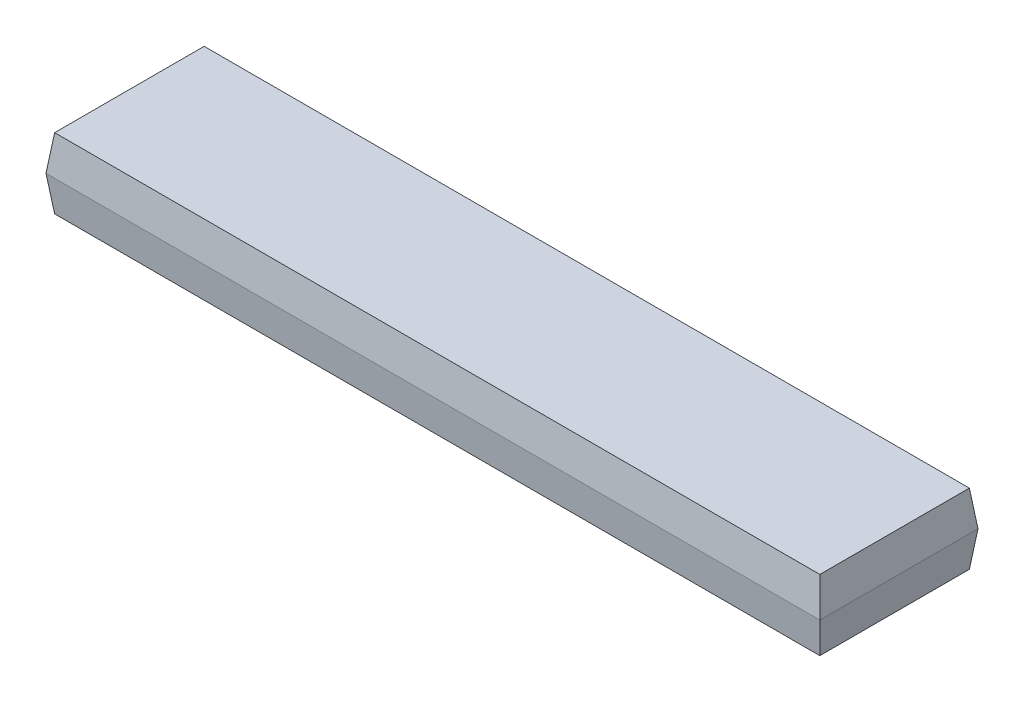
ISO-10303-21;
HEADER;
FILE_DESCRIPTION(('STEP AP214'),'2;1');
FILE_NAME('part.step','',(''),(''),'','','');
FILE_SCHEMA(('AUTOMOTIVE_DESIGN { 1 0 10303 214 1 1 1 1 }'));
ENDSEC;
DATA;
#1=APPLICATION_CONTEXT('core data for automotive mechanical design processes');
#2=APPLICATION_PROTOCOL_DEFINITION('international standard','automotive_design',2000,#1);
#3=PRODUCT_CONTEXT('',#1,'mechanical');
#4=PRODUCT('Part','Part','',(#3));
#5=PRODUCT_RELATED_PRODUCT_CATEGORY('part','',(#4));
#6=PRODUCT_DEFINITION_FORMATION('','',#4);
#7=PRODUCT_DEFINITION_CONTEXT('part definition',#1,'design');
#8=PRODUCT_DEFINITION('design','',#6,#7);
#9=PRODUCT_DEFINITION_SHAPE('','',#8);
#10=(LENGTH_UNIT() NAMED_UNIT(*) SI_UNIT(.MILLI.,.METRE.));
#11=(NAMED_UNIT(*) PLANE_ANGLE_UNIT() SI_UNIT($,.RADIAN.));
#12=(NAMED_UNIT(*) SI_UNIT($,.STERADIAN.) SOLID_ANGLE_UNIT());
#13=UNCERTAINTY_MEASURE_WITH_UNIT(LENGTH_MEASURE(1.E-05),#10,'distance_accuracy_value','');
#14=(GEOMETRIC_REPRESENTATION_CONTEXT(3) GLOBAL_UNCERTAINTY_ASSIGNED_CONTEXT((#13)) GLOBAL_UNIT_ASSIGNED_CONTEXT((#10,
#11,#12)) REPRESENTATION_CONTEXT('',''));
#15=CARTESIAN_POINT('',(0.,0.,0.));
#16=DIRECTION('',(0.,0.,1.));
#17=DIRECTION('',(1.,0.,0.));
#18=AXIS2_PLACEMENT_3D('',#15,#16,#17);
#19=CARTESIAN_POINT('',(0.,0.,0.));
#20=DIRECTION('',(-0.992546151641322,-0.121869343405148,0.));
#21=DIRECTION('',(0.121869343405148,-0.992546151641322,0.));
#22=AXIS2_PLACEMENT_3D('',#19,#20,#21);
#23=PLANE('',#22);
#24=DIRECTION('',(0.,0.,1.));
#25=VECTOR('',#24,1.);
#26=CARTESIAN_POINT('',(0.,0.,0.));
#27=LINE('',#26,#25);
#28=CARTESIAN_POINT('',(0.,0.,-6.8));
#29=VERTEX_POINT('',#28);
#30=CARTESIAN_POINT('',(0.,0.,0.));
#31=VERTEX_POINT('',#30);
#32=EDGE_CURVE('E136',#29,#31,#27,.T.);
#33=ORIENTED_EDGE('',*,*,#32,.T.);
#34=DIRECTION('',(0.120974291151355,-0.985256536015293,-0.120974291151355));
#35=VECTOR('',#34,1.);
#36=CARTESIAN_POINT('',(0.,0.,0.));
#37=LINE('',#36,#35);
#38=CARTESIAN_POINT('',(-0.196455297444648,1.6,0.196455297444648));
#39=VERTEX_POINT('',#38);
#40=EDGE_CURVE('E11',#39,#31,#37,.T.);
#41=ORIENTED_EDGE('',*,*,#40,.F.);
#42=DIRECTION('',(0.,0.,-1.));
#43=VECTOR('',#42,1.);
#44=CARTESIAN_POINT('',(-0.196455297444648,1.6,0.));
#45=LINE('',#44,#43);
#46=CARTESIAN_POINT('',(-0.196455297444648,1.6,-6.99645529744465));
#47=VERTEX_POINT('',#46);
#48=EDGE_CURVE('E90',#47,#39,#45,.F.);
#49=ORIENTED_EDGE('',*,*,#48,.F.);
#50=DIRECTION('',(0.120974291151355,-0.985256536015293,0.120974291151355));
#51=VECTOR('',#50,1.);
#52=CARTESIAN_POINT('',(0.0995164980130948,-0.810496835117488,-6.7004835019869));
#53=LINE('',#52,#51);
#54=EDGE_CURVE('E93',#47,#29,#53,.T.);
#55=ORIENTED_EDGE('',*,*,#54,.T.);
#56=EDGE_LOOP('',(#33,#41,#49,#55));
#57=FACE_BOUND('',#56,.T.);
#58=ADVANCED_FACE('F35',(#57),#23,.T.);
#59=CARTESIAN_POINT('',(0.,0.,0.));
#60=DIRECTION('',(0.,-0.121869343405148,0.992546151641322));
#61=DIRECTION('',(0.,-0.992546151641322,-0.121869343405148));
#62=AXIS2_PLACEMENT_3D('',#59,#60,#61);
#63=PLANE('',#62);
#64=DIRECTION('',(1.,0.,0.));
#65=VECTOR('',#64,1.);
#66=CARTESIAN_POINT('',(0.,0.,0.));
#67=LINE('',#66,#65);
#68=CARTESIAN_POINT('',(34.8,0.,0.));
#69=VERTEX_POINT('',#68);
#70=EDGE_CURVE('E138',#31,#69,#67,.T.);
#71=ORIENTED_EDGE('',*,*,#70,.T.);
#72=DIRECTION('',(-0.120974291151355,-0.985256536015293,-0.120974291151355));
#73=VECTOR('',#72,1.);
#74=CARTESIAN_POINT('',(34.8,0.,0.));
#75=LINE('',#74,#73);
#76=CARTESIAN_POINT('',(34.9964552974446,1.6,0.196455297444648));
#77=VERTEX_POINT('',#76);
#78=EDGE_CURVE('E44',#77,#69,#75,.T.);
#79=ORIENTED_EDGE('',*,*,#78,.F.);
#80=DIRECTION('',(-1.,0.,0.));
#81=VECTOR('',#80,1.);
#82=CARTESIAN_POINT('',(0.,1.6,0.196455297444648));
#83=LINE('',#82,#81);
#84=EDGE_CURVE('E99',#39,#77,#83,.F.);
#85=ORIENTED_EDGE('',*,*,#84,.F.);
#86=ORIENTED_EDGE('',*,*,#40,.T.);
#87=EDGE_LOOP('',(#71,#79,#85,#86));
#88=FACE_BOUND('',#87,.T.);
#89=ADVANCED_FACE('F37',(#88),#63,.T.);
#90=CARTESIAN_POINT('',(34.8,0.,0.));
#91=DIRECTION('',(0.992546151641322,-0.121869343405148,0.));
#92=DIRECTION('',(0.121869343405148,0.992546151641322,0.));
#93=AXIS2_PLACEMENT_3D('',#90,#91,#92);
#94=PLANE('',#93);
#95=DIRECTION('',(0.,0.,-1.));
#96=VECTOR('',#95,1.);
#97=CARTESIAN_POINT('',(34.8,0.,0.));
#98=LINE('',#97,#96);
#99=CARTESIAN_POINT('',(34.8,0.,-6.8));
#100=VERTEX_POINT('',#99);
#101=EDGE_CURVE('E140',#69,#100,#98,.T.);
#102=ORIENTED_EDGE('',*,*,#101,.T.);
#103=DIRECTION('',(-0.120974291151355,-0.985256536015293,0.120974291151355));
#104=VECTOR('',#103,1.);
#105=CARTESIAN_POINT('',(34.2907096866389,-4.14783674442479,-6.29070968663887));
#106=LINE('',#105,#104);
#107=CARTESIAN_POINT('',(34.9964552974446,1.6,-6.99645529744465));
#108=VERTEX_POINT('',#107);
#109=EDGE_CURVE('E52',#108,#100,#106,.T.);
#110=ORIENTED_EDGE('',*,*,#109,.F.);
#111=DIRECTION('',(0.,0.,1.));
#112=VECTOR('',#111,1.);
#113=CARTESIAN_POINT('',(34.9964552974446,1.6,0.));
#114=LINE('',#113,#112);
#115=EDGE_CURVE('E117',#77,#108,#114,.F.);
#116=ORIENTED_EDGE('',*,*,#115,.F.);
#117=ORIENTED_EDGE('',*,*,#78,.T.);
#118=EDGE_LOOP('',(#102,#110,#116,#117));
#119=FACE_BOUND('',#118,.T.);
#120=ADVANCED_FACE('F150',(#119),#94,.T.);
#121=CARTESIAN_POINT('',(0.,0.,-6.8));
#122=DIRECTION('',(0.,-0.121869343405148,-0.992546151641322));
#123=DIRECTION('',(0.,0.992546151641322,-0.121869343405148));
#124=AXIS2_PLACEMENT_3D('',#121,#122,#123);
#125=PLANE('',#124);
#126=DIRECTION('',(-1.,0.,0.));
#127=VECTOR('',#126,1.);
#128=CARTESIAN_POINT('',(0.,0.,-6.8));
#129=LINE('',#128,#127);
#130=EDGE_CURVE('E100',#100,#29,#129,.T.);
#131=ORIENTED_EDGE('',*,*,#130,.T.);
#132=ORIENTED_EDGE('',*,*,#54,.F.);
#133=DIRECTION('',(1.,0.,0.));
#134=VECTOR('',#133,1.);
#135=CARTESIAN_POINT('',(0.,1.6,-6.99645529744465));
#136=LINE('',#135,#134);
#137=EDGE_CURVE('E39',#108,#47,#136,.F.);
#138=ORIENTED_EDGE('',*,*,#137,.F.);
#139=ORIENTED_EDGE('',*,*,#109,.T.);
#140=EDGE_LOOP('',(#131,#132,#138,#139));
#141=FACE_BOUND('',#140,.T.);
#142=ADVANCED_FACE('F104',(#141),#125,.T.);
#143=CARTESIAN_POINT('',(0.,0.,0.));
#144=DIRECTION('',(0.,-1.,0.));
#145=DIRECTION('',(0.,0.,-1.));
#146=AXIS2_PLACEMENT_3D('',#143,#144,#145);
#147=PLANE('',#146);
#148=ORIENTED_EDGE('',*,*,#32,.F.);
#149=ORIENTED_EDGE('',*,*,#130,.F.);
#150=ORIENTED_EDGE('',*,*,#101,.F.);
#151=ORIENTED_EDGE('',*,*,#70,.F.);
#152=EDGE_LOOP('',(#148,#149,#150,#151));
#153=FACE_BOUND('',#152,.T.);
#154=ADVANCED_FACE('F155',(#153),#147,.T.);
#155=CARTESIAN_POINT('',(-0.196455297444648,1.6,-6.99645529744465));
#156=DIRECTION('',(-0.992546151641322,0.121869343405148,0.));
#157=DIRECTION('',(-0.121869343405148,-0.992546151641322,0.));
#158=AXIS2_PLACEMENT_3D('',#155,#156,#157);
#159=PLANE('',#158);
#160=ORIENTED_EDGE('',*,*,#48,.T.);
#161=DIRECTION('',(-0.120974291151355,-0.985256536015293,0.120974291151355));
#162=VECTOR('',#161,1.);
#163=CARTESIAN_POINT('',(-0.196455297444648,1.6,0.196455297444648));
#164=LINE('',#163,#162);
#165=CARTESIAN_POINT('',(0.,3.2,0.));
#166=VERTEX_POINT('',#165);
#167=EDGE_CURVE('E128',#166,#39,#164,.T.);
#168=ORIENTED_EDGE('',*,*,#167,.F.);
#169=DIRECTION('',(0.,0.,-1.));
#170=VECTOR('',#169,1.);
#171=CARTESIAN_POINT('',(0.,3.2,-6.99645529744465));
#172=LINE('',#171,#170);
#173=CARTESIAN_POINT('',(0.,3.2,-6.8));
#174=VERTEX_POINT('',#173);
#175=EDGE_CURVE('E120',#174,#166,#172,.F.);
#176=ORIENTED_EDGE('',*,*,#175,.F.);
#177=DIRECTION('',(-0.120974291151355,-0.985256536015293,-0.120974291151355));
#178=VECTOR('',#177,1.);
#179=CARTESIAN_POINT('',(-0.196455297444648,1.6,-6.99645529744465));
#180=LINE('',#179,#178);
#181=EDGE_CURVE('E113',#174,#47,#180,.T.);
#182=ORIENTED_EDGE('',*,*,#181,.T.);
#183=EDGE_LOOP('',(#160,#168,#176,#182));
#184=FACE_BOUND('',#183,.T.);
#185=ADVANCED_FACE('F118',(#184),#159,.T.);
#186=CARTESIAN_POINT('',(-0.196455297444648,1.6,0.196455297444648));
#187=DIRECTION('',(0.,0.121869343405148,0.992546151641322));
#188=DIRECTION('',(0.,-0.992546151641322,0.121869343405148));
#189=AXIS2_PLACEMENT_3D('',#186,#187,#188);
#190=PLANE('',#189);
#191=ORIENTED_EDGE('',*,*,#84,.T.);
#192=DIRECTION('',(0.120974291151355,-0.985256536015293,0.120974291151355));
#193=VECTOR('',#192,1.);
#194=CARTESIAN_POINT('',(34.8911886396616,2.45732812830012,0.0911886396616083));
#195=LINE('',#194,#193);
#196=CARTESIAN_POINT('',(34.8,3.2,0.));
#197=VERTEX_POINT('',#196);
#198=EDGE_CURVE('E123',#197,#77,#195,.T.);
#199=ORIENTED_EDGE('',*,*,#198,.F.);
#200=DIRECTION('',(-1.,0.,0.));
#201=VECTOR('',#200,1.);
#202=CARTESIAN_POINT('',(-0.196455297444648,3.2,0.));
#203=LINE('',#202,#201);
#204=EDGE_CURVE('E133',#166,#197,#203,.F.);
#205=ORIENTED_EDGE('',*,*,#204,.F.);
#206=ORIENTED_EDGE('',*,*,#167,.T.);
#207=EDGE_LOOP('',(#191,#199,#205,#206));
#208=FACE_BOUND('',#207,.T.);
#209=ADVANCED_FACE('F153',(#208),#190,.T.);
#210=CARTESIAN_POINT('',(34.9964552974446,1.6,-6.99645529744465));
#211=DIRECTION('',(0.992546151641322,0.121869343405148,0.));
#212=DIRECTION('',(-0.121869343405148,0.992546151641322,0.));
#213=AXIS2_PLACEMENT_3D('',#210,#211,#212);
#214=PLANE('',#213);
#215=ORIENTED_EDGE('',*,*,#115,.T.);
#216=DIRECTION('',(0.120974291151355,-0.985256536015293,-0.120974291151355));
#217=VECTOR('',#216,1.);
#218=CARTESIAN_POINT('',(34.4814148243136,5.79466803760742,-6.48141482431357));
#219=LINE('',#218,#217);
#220=CARTESIAN_POINT('',(34.8,3.2,-6.8));
#221=VERTEX_POINT('',#220);
#222=EDGE_CURVE('E116',#221,#108,#219,.T.);
#223=ORIENTED_EDGE('',*,*,#222,.F.);
#224=DIRECTION('',(0.,0.,1.));
#225=VECTOR('',#224,1.);
#226=CARTESIAN_POINT('',(34.8,3.2,-6.99645529744465));
#227=LINE('',#226,#225);
#228=EDGE_CURVE('E125',#197,#221,#227,.F.);
#229=ORIENTED_EDGE('',*,*,#228,.F.);
#230=ORIENTED_EDGE('',*,*,#198,.T.);
#231=EDGE_LOOP('',(#215,#223,#229,#230));
#232=FACE_BOUND('',#231,.T.);
#233=ADVANCED_FACE('F147',(#232),#214,.T.);
#234=CARTESIAN_POINT('',(-0.196455297444648,1.6,-6.99645529744465));
#235=DIRECTION('',(0.,0.121869343405148,-0.992546151641322));
#236=DIRECTION('',(0.,0.992546151641322,0.121869343405148));
#237=AXIS2_PLACEMENT_3D('',#234,#235,#236);
#238=PLANE('',#237);
#239=ORIENTED_EDGE('',*,*,#137,.T.);
#240=ORIENTED_EDGE('',*,*,#181,.F.);
#241=DIRECTION('',(1.,0.,0.));
#242=VECTOR('',#241,1.);
#243=CARTESIAN_POINT('',(-0.196455297444648,3.2,-6.8));
#244=LINE('',#243,#242);
#245=EDGE_CURVE('E121',#221,#174,#244,.F.);
#246=ORIENTED_EDGE('',*,*,#245,.F.);
#247=ORIENTED_EDGE('',*,*,#222,.T.);
#248=EDGE_LOOP('',(#239,#240,#246,#247));
#249=FACE_BOUND('',#248,.T.);
#250=ADVANCED_FACE('F111',(#249),#238,.T.);
#251=CARTESIAN_POINT('',(0.,3.2,0.));
#252=DIRECTION('',(0.,1.,0.));
#253=DIRECTION('',(0.,0.,1.));
#254=AXIS2_PLACEMENT_3D('',#251,#252,#253);
#255=PLANE('',#254);
#256=ORIENTED_EDGE('',*,*,#175,.T.);
#257=ORIENTED_EDGE('',*,*,#204,.T.);
#258=ORIENTED_EDGE('',*,*,#228,.T.);
#259=ORIENTED_EDGE('',*,*,#245,.T.);
#260=EDGE_LOOP('',(#256,#257,#258,#259));
#261=FACE_BOUND('',#260,.T.);
#262=ADVANCED_FACE('F191',(#261),#255,.T.);
#263=CLOSED_SHELL('',(#58,#89,#120,#142,#154,#185,#209,#233,#250,#262));
#264=MANIFOLD_SOLID_BREP('B2',#263);
#265=ADVANCED_BREP_SHAPE_REPRESENTATION('',(#18,#264),#14);
#266=SHAPE_DEFINITION_REPRESENTATION(#9,#265);
ENDSEC;
END-ISO-10303-21;
